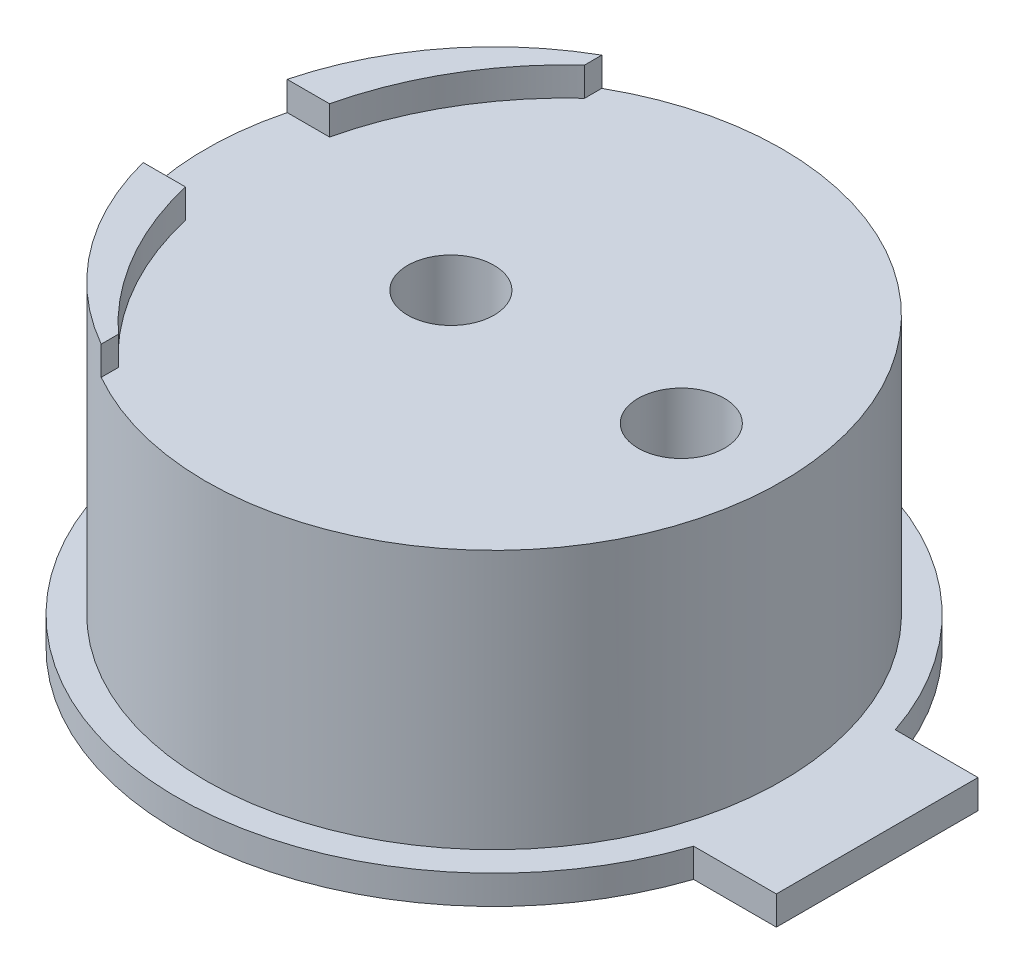
ISO-10303-21;
HEADER;
FILE_DESCRIPTION(('STEP AP214'),'2;1');
FILE_NAME('part.step','',(''),(''),'','','');
FILE_SCHEMA(('AUTOMOTIVE_DESIGN { 1 0 10303 214 1 1 1 1 }'));
ENDSEC;
DATA;
#1=APPLICATION_CONTEXT('core data for automotive mechanical design processes');
#2=APPLICATION_PROTOCOL_DEFINITION('international standard','automotive_design',2000,#1);
#3=PRODUCT_CONTEXT('',#1,'mechanical');
#4=PRODUCT('Part','Part','',(#3));
#5=PRODUCT_RELATED_PRODUCT_CATEGORY('part','',(#4));
#6=PRODUCT_DEFINITION_FORMATION('','',#4);
#7=PRODUCT_DEFINITION_CONTEXT('part definition',#1,'design');
#8=PRODUCT_DEFINITION('design','',#6,#7);
#9=PRODUCT_DEFINITION_SHAPE('','',#8);
#10=(LENGTH_UNIT() NAMED_UNIT(*) SI_UNIT(.MILLI.,.METRE.));
#11=(NAMED_UNIT(*) PLANE_ANGLE_UNIT() SI_UNIT($,.RADIAN.));
#12=(NAMED_UNIT(*) SI_UNIT($,.STERADIAN.) SOLID_ANGLE_UNIT());
#13=UNCERTAINTY_MEASURE_WITH_UNIT(LENGTH_MEASURE(1.E-05),#10,'distance_accuracy_value','');
#14=(GEOMETRIC_REPRESENTATION_CONTEXT(3) GLOBAL_UNCERTAINTY_ASSIGNED_CONTEXT((#13)) GLOBAL_UNIT_ASSIGNED_CONTEXT((#10,
#11,#12)) REPRESENTATION_CONTEXT('',''));
#15=CARTESIAN_POINT('',(0.,0.,0.));
#16=DIRECTION('',(0.,0.,1.));
#17=DIRECTION('',(1.,0.,0.));
#18=AXIS2_PLACEMENT_3D('',#15,#16,#17);
#19=CARTESIAN_POINT('',(-2.5,30.,0.));
#20=DIRECTION('',(0.,-1.,0.));
#21=DIRECTION('',(0.,0.,-1.));
#22=AXIS2_PLACEMENT_3D('',#19,#20,#21);
#23=CYLINDRICAL_SURFACE('',#22,10.);
#24=CARTESIAN_POINT('',(-2.5,21.,0.));
#25=DIRECTION('',(0.,1.,0.));
#26=DIRECTION('',(0.,0.,1.));
#27=AXIS2_PLACEMENT_3D('',#24,#25,#26);
#28=CIRCLE('',#27,10.);
#29=CARTESIAN_POINT('',(-2.5,21.,10.));
#30=VERTEX_POINT('',#29);
#31=EDGE_CURVE('E192',#30,#30,#28,.T.);
#32=ORIENTED_EDGE('',*,*,#31,.T.);
#33=EDGE_LOOP('',(#32));
#34=FACE_BOUND('',#33,.T.);
#35=CARTESIAN_POINT('',(-2.5,31.,0.));
#36=DIRECTION('',(0.,1.,0.));
#37=DIRECTION('',(0.,0.,1.));
#38=AXIS2_PLACEMENT_3D('',#35,#36,#37);
#39=CIRCLE('',#38,10.);
#40=CARTESIAN_POINT('',(-7.44999999999999,31.,-8.68892973846607));
#41=VERTEX_POINT('',#40);
#42=CARTESIAN_POINT('',(-12.1824583655185,31.,-2.5));
#43=VERTEX_POINT('',#42);
#44=EDGE_CURVE('E57',#41,#43,#39,.T.);
#45=ORIENTED_EDGE('',*,*,#44,.F.);
#46=DIRECTION('',(0.,1.,0.));
#47=VECTOR('',#46,1.);
#48=CARTESIAN_POINT('',(-7.44999999999999,30.,-8.68892973846607));
#49=LINE('',#48,#47);
#50=CARTESIAN_POINT('',(-7.44999999999999,30.,-8.68892973846607));
#51=VERTEX_POINT('',#50);
#52=EDGE_CURVE('E136',#51,#41,#49,.T.);
#53=ORIENTED_EDGE('',*,*,#52,.F.);
#54=CARTESIAN_POINT('',(-2.5,30.,0.));
#55=DIRECTION('',(0.,1.,0.));
#56=DIRECTION('',(0.,0.,1.));
#57=AXIS2_PLACEMENT_3D('',#54,#55,#56);
#58=CIRCLE('',#57,10.);
#59=CARTESIAN_POINT('',(-7.44999999999999,30.,8.68892973846607));
#60=VERTEX_POINT('',#59);
#61=EDGE_CURVE('E123',#60,#51,#58,.T.);
#62=ORIENTED_EDGE('',*,*,#61,.F.);
#63=DIRECTION('',(0.,1.,0.));
#64=VECTOR('',#63,1.);
#65=CARTESIAN_POINT('',(-7.44999999999999,30.,8.68892973846607));
#66=LINE('',#65,#64);
#67=CARTESIAN_POINT('',(-7.44999999999999,31.,8.68892973846607));
#68=VERTEX_POINT('',#67);
#69=EDGE_CURVE('E149',#60,#68,#66,.T.);
#70=ORIENTED_EDGE('',*,*,#69,.T.);
#71=CARTESIAN_POINT('',(-12.1824583655185,31.,2.5));
#72=VERTEX_POINT('',#71);
#73=EDGE_CURVE('E221',#72,#68,#39,.T.);
#74=ORIENTED_EDGE('',*,*,#73,.F.);
#75=DIRECTION('',(0.,-1.,0.));
#76=VECTOR('',#75,1.);
#77=CARTESIAN_POINT('',(-12.1824583655185,30.,2.5));
#78=LINE('',#77,#76);
#79=CARTESIAN_POINT('',(-12.1824583655185,30.,2.5));
#80=VERTEX_POINT('',#79);
#81=EDGE_CURVE('E11',#72,#80,#78,.T.);
#82=ORIENTED_EDGE('',*,*,#81,.T.);
#83=CARTESIAN_POINT('',(-2.5,30.,0.));
#84=DIRECTION('',(0.,1.,0.));
#85=DIRECTION('',(0.,0.,1.));
#86=AXIS2_PLACEMENT_3D('',#83,#84,#85);
#87=CIRCLE('',#86,10.);
#88=CARTESIAN_POINT('',(-12.1824583655185,30.,-2.5));
#89=VERTEX_POINT('',#88);
#90=EDGE_CURVE('E132',#89,#80,#87,.T.);
#91=ORIENTED_EDGE('',*,*,#90,.F.);
#92=DIRECTION('',(0.,-1.,0.));
#93=VECTOR('',#92,1.);
#94=CARTESIAN_POINT('',(-12.1824583655185,30.,-2.5));
#95=LINE('',#94,#93);
#96=EDGE_CURVE('E42',#43,#89,#95,.T.);
#97=ORIENTED_EDGE('',*,*,#96,.F.);
#98=EDGE_LOOP('',(#45,#53,#62,#70,#74,#82,#91,#97));
#99=FACE_BOUND('',#98,.T.);
#100=ADVANCED_FACE('F35',(#34,#99),#23,.T.);
#101=CARTESIAN_POINT('',(0.,31.,0.));
#102=DIRECTION('',(0.,1.,0.));
#103=DIRECTION('',(0.,0.,1.));
#104=AXIS2_PLACEMENT_3D('',#101,#102,#103);
#105=PLANE('',#104);
#106=ORIENTED_EDGE('',*,*,#73,.T.);
#107=DIRECTION('',(0.,0.,-1.));
#108=VECTOR('',#107,1.);
#109=CARTESIAN_POINT('',(-7.44999999999999,31.,0.));
#110=LINE('',#109,#108);
#111=CARTESIAN_POINT('',(-7.44999999999999,31.,8.09305257612973));
#112=VERTEX_POINT('',#111);
#113=EDGE_CURVE('E150',#68,#112,#110,.T.);
#114=ORIENTED_EDGE('',*,*,#113,.T.);
#115=CARTESIAN_POINT('',(0.,31.,0.));
#116=DIRECTION('',(0.,1.,0.));
#117=DIRECTION('',(0.,0.,1.));
#118=AXIS2_PLACEMENT_3D('',#115,#116,#117);
#119=CIRCLE('',#118,11.);
#120=CARTESIAN_POINT('',(-10.7121426428143,31.,2.5));
#121=VERTEX_POINT('',#120);
#122=EDGE_CURVE('E197',#121,#112,#119,.T.);
#123=ORIENTED_EDGE('',*,*,#122,.F.);
#124=DIRECTION('',(1.,0.,0.));
#125=VECTOR('',#124,1.);
#126=CARTESIAN_POINT('',(0.,31.,2.5));
#127=LINE('',#126,#125);
#128=EDGE_CURVE('E205',#72,#121,#127,.T.);
#129=ORIENTED_EDGE('',*,*,#128,.F.);
#130=EDGE_LOOP('',(#106,#114,#123,#129));
#131=FACE_BOUND('',#130,.T.);
#132=ADVANCED_FACE('F239',(#131),#105,.T.);
#133=CARTESIAN_POINT('',(0.,30.,0.));
#134=DIRECTION('',(0.,1.,0.));
#135=DIRECTION('',(0.,0.,1.));
#136=AXIS2_PLACEMENT_3D('',#133,#134,#135);
#137=CYLINDRICAL_SURFACE('',#136,11.);
#138=DIRECTION('',(0.,1.,0.));
#139=VECTOR('',#138,1.);
#140=CARTESIAN_POINT('',(-7.44999999999999,30.,8.09305257612973));
#141=LINE('',#140,#139);
#142=CARTESIAN_POINT('',(-7.44999999999999,30.,8.09305257612973));
#143=VERTEX_POINT('',#142);
#144=EDGE_CURVE('E153',#143,#112,#141,.T.);
#145=ORIENTED_EDGE('',*,*,#144,.F.);
#146=CARTESIAN_POINT('',(0.,30.,0.));
#147=DIRECTION('',(0.,1.,0.));
#148=DIRECTION('',(0.,0.,1.));
#149=AXIS2_PLACEMENT_3D('',#146,#147,#148);
#150=CIRCLE('',#149,11.);
#151=CARTESIAN_POINT('',(-10.7121426428143,30.,2.5));
#152=VERTEX_POINT('',#151);
#153=EDGE_CURVE('E200',#152,#143,#150,.T.);
#154=ORIENTED_EDGE('',*,*,#153,.F.);
#155=DIRECTION('',(0.,1.,0.));
#156=VECTOR('',#155,1.);
#157=CARTESIAN_POINT('',(-10.7121426428143,30.,2.5));
#158=LINE('',#157,#156);
#159=EDGE_CURVE('E202',#152,#121,#158,.T.);
#160=ORIENTED_EDGE('',*,*,#159,.T.);
#161=ORIENTED_EDGE('',*,*,#122,.T.);
#162=EDGE_LOOP('',(#145,#154,#160,#161));
#163=FACE_BOUND('',#162,.T.);
#164=ADVANCED_FACE('F242',(#163),#137,.F.);
#165=CARTESIAN_POINT('',(4.,3.,0.));
#166=DIRECTION('',(0.,1.,0.));
#167=DIRECTION('',(0.,0.,1.));
#168=AXIS2_PLACEMENT_3D('',#165,#166,#167);
#169=CYLINDRICAL_SURFACE('',#168,1.5);
#170=CARTESIAN_POINT('',(4.,30.,0.));
#171=DIRECTION('',(0.,1.,0.));
#172=DIRECTION('',(0.,0.,1.));
#173=AXIS2_PLACEMENT_3D('',#170,#171,#172);
#174=CIRCLE('',#173,1.5);
#175=CARTESIAN_POINT('',(4.,30.,1.5));
#176=VERTEX_POINT('',#175);
#177=EDGE_CURVE('E213',#176,#176,#174,.F.);
#178=ORIENTED_EDGE('',*,*,#177,.F.);
#179=EDGE_LOOP('',(#178));
#180=FACE_BOUND('',#179,.T.);
#181=CARTESIAN_POINT('',(4.,20.,0.));
#182=DIRECTION('',(0.,-1.,0.));
#183=DIRECTION('',(0.,0.,-1.));
#184=AXIS2_PLACEMENT_3D('',#181,#182,#183);
#185=CIRCLE('',#184,1.5);
#186=CARTESIAN_POINT('',(4.,20.,-1.5));
#187=VERTEX_POINT('',#186);
#188=EDGE_CURVE('E167',#187,#187,#185,.F.);
#189=ORIENTED_EDGE('',*,*,#188,.F.);
#190=EDGE_LOOP('',(#189));
#191=FACE_BOUND('',#190,.T.);
#192=ADVANCED_FACE('F292',(#180,#191),#169,.F.);
#193=CARTESIAN_POINT('',(-4.,3.,0.));
#194=DIRECTION('',(0.,1.,0.));
#195=DIRECTION('',(0.,0.,1.));
#196=AXIS2_PLACEMENT_3D('',#193,#194,#195);
#197=CYLINDRICAL_SURFACE('',#196,1.5);
#198=CARTESIAN_POINT('',(-4.,30.,0.));
#199=DIRECTION('',(0.,1.,0.));
#200=DIRECTION('',(0.,0.,1.));
#201=AXIS2_PLACEMENT_3D('',#198,#199,#200);
#202=CIRCLE('',#201,1.5);
#203=CARTESIAN_POINT('',(-4.,30.,1.5));
#204=VERTEX_POINT('',#203);
#205=EDGE_CURVE('E218',#204,#204,#202,.F.);
#206=ORIENTED_EDGE('',*,*,#205,.F.);
#207=EDGE_LOOP('',(#206));
#208=FACE_BOUND('',#207,.T.);
#209=CARTESIAN_POINT('',(-4.,20.,0.));
#210=DIRECTION('',(0.,-1.,0.));
#211=DIRECTION('',(0.,0.,-1.));
#212=AXIS2_PLACEMENT_3D('',#209,#210,#211);
#213=CIRCLE('',#212,1.5);
#214=CARTESIAN_POINT('',(-4.,20.,-1.5));
#215=VERTEX_POINT('',#214);
#216=EDGE_CURVE('E170',#215,#215,#213,.F.);
#217=ORIENTED_EDGE('',*,*,#216,.F.);
#218=EDGE_LOOP('',(#217));
#219=FACE_BOUND('',#218,.T.);
#220=ADVANCED_FACE('F290',(#208,#219),#197,.F.);
#221=DIRECTION('',(0.,0.,1.));
#222=VECTOR('',#221,1.);
#223=CARTESIAN_POINT('',(-7.44999999999999,31.,0.));
#224=LINE('',#223,#222);
#225=CARTESIAN_POINT('',(-7.44999999999999,31.,-8.09305257612973));
#226=VERTEX_POINT('',#225);
#227=EDGE_CURVE('E140',#41,#226,#224,.T.);
#228=ORIENTED_EDGE('',*,*,#227,.F.);
#229=ORIENTED_EDGE('',*,*,#44,.T.);
#230=DIRECTION('',(1.,0.,0.));
#231=VECTOR('',#230,1.);
#232=CARTESIAN_POINT('',(0.,31.,-2.5));
#233=LINE('',#232,#231);
#234=CARTESIAN_POINT('',(-10.7121426428143,31.,-2.5));
#235=VERTEX_POINT('',#234);
#236=EDGE_CURVE('E203',#43,#235,#233,.T.);
#237=ORIENTED_EDGE('',*,*,#236,.T.);
#238=EDGE_CURVE('E207',#226,#235,#119,.T.);
#239=ORIENTED_EDGE('',*,*,#238,.F.);
#240=EDGE_LOOP('',(#228,#229,#237,#239));
#241=FACE_BOUND('',#240,.T.);
#242=ADVANCED_FACE('F263',(#241),#105,.T.);
#243=CARTESIAN_POINT('',(0.,30.,0.));
#244=DIRECTION('',(0.,1.,0.));
#245=DIRECTION('',(0.,0.,1.));
#246=AXIS2_PLACEMENT_3D('',#243,#244,#245);
#247=PLANE('',#246);
#248=ORIENTED_EDGE('',*,*,#90,.T.);
#249=DIRECTION('',(1.,0.,0.));
#250=VECTOR('',#249,1.);
#251=CARTESIAN_POINT('',(0.,30.,2.5));
#252=LINE('',#251,#250);
#253=EDGE_CURVE('E196',#80,#152,#252,.T.);
#254=ORIENTED_EDGE('',*,*,#253,.T.);
#255=ORIENTED_EDGE('',*,*,#153,.T.);
#256=DIRECTION('',(0.,0.,-1.));
#257=VECTOR('',#256,1.);
#258=CARTESIAN_POINT('',(-7.44999999999999,30.,0.));
#259=LINE('',#258,#257);
#260=EDGE_CURVE('E127',#60,#143,#259,.T.);
#261=ORIENTED_EDGE('',*,*,#260,.F.);
#262=ORIENTED_EDGE('',*,*,#61,.T.);
#263=DIRECTION('',(0.,0.,1.));
#264=VECTOR('',#263,1.);
#265=CARTESIAN_POINT('',(-7.44999999999999,30.,0.));
#266=LINE('',#265,#264);
#267=CARTESIAN_POINT('',(-7.44999999999999,30.,-8.09305257612973));
#268=VERTEX_POINT('',#267);
#269=EDGE_CURVE('E49',#51,#268,#266,.T.);
#270=ORIENTED_EDGE('',*,*,#269,.T.);
#271=CARTESIAN_POINT('',(-10.7121426428143,30.,-2.5));
#272=VERTEX_POINT('',#271);
#273=EDGE_CURVE('E199',#268,#272,#150,.T.);
#274=ORIENTED_EDGE('',*,*,#273,.T.);
#275=DIRECTION('',(1.,0.,0.));
#276=VECTOR('',#275,1.);
#277=CARTESIAN_POINT('',(0.,30.,-2.5));
#278=LINE('',#277,#276);
#279=EDGE_CURVE('E193',#89,#272,#278,.T.);
#280=ORIENTED_EDGE('',*,*,#279,.F.);
#281=EDGE_LOOP('',(#248,#254,#255,#261,#262,#270,#274,#280));
#282=FACE_BOUND('',#281,.T.);
#283=ORIENTED_EDGE('',*,*,#177,.T.);
#284=EDGE_LOOP('',(#283));
#285=FACE_BOUND('',#284,.T.);
#286=ORIENTED_EDGE('',*,*,#205,.T.);
#287=EDGE_LOOP('',(#286));
#288=FACE_BOUND('',#287,.T.);
#289=ADVANCED_FACE('F124',(#282,#285,#288),#247,.T.);
#290=CARTESIAN_POINT('',(0.,30.,-2.5));
#291=DIRECTION('',(0.,0.,1.));
#292=DIRECTION('',(0.,-1.,0.));
#293=AXIS2_PLACEMENT_3D('',#290,#291,#292);
#294=PLANE('',#293);
#295=ORIENTED_EDGE('',*,*,#96,.T.);
#296=ORIENTED_EDGE('',*,*,#279,.T.);
#297=DIRECTION('',(0.,1.,0.));
#298=VECTOR('',#297,1.);
#299=CARTESIAN_POINT('',(-10.7121426428143,30.,-2.5));
#300=LINE('',#299,#298);
#301=EDGE_CURVE('E210',#272,#235,#300,.T.);
#302=ORIENTED_EDGE('',*,*,#301,.T.);
#303=ORIENTED_EDGE('',*,*,#236,.F.);
#304=EDGE_LOOP('',(#295,#296,#302,#303));
#305=FACE_BOUND('',#304,.T.);
#306=ADVANCED_FACE('F227',(#305),#294,.T.);
#307=CARTESIAN_POINT('',(0.,30.,2.5));
#308=DIRECTION('',(0.,0.,1.));
#309=DIRECTION('',(0.,-1.,0.));
#310=AXIS2_PLACEMENT_3D('',#307,#308,#309);
#311=PLANE('',#310);
#312=ORIENTED_EDGE('',*,*,#128,.T.);
#313=ORIENTED_EDGE('',*,*,#159,.F.);
#314=ORIENTED_EDGE('',*,*,#253,.F.);
#315=ORIENTED_EDGE('',*,*,#81,.F.);
#316=EDGE_LOOP('',(#312,#313,#314,#315));
#317=FACE_BOUND('',#316,.T.);
#318=ADVANCED_FACE('F235',(#317),#311,.F.);
#319=ORIENTED_EDGE('',*,*,#273,.F.);
#320=DIRECTION('',(0.,1.,0.));
#321=VECTOR('',#320,1.);
#322=CARTESIAN_POINT('',(-7.44999999999999,30.,-8.09305257612973));
#323=LINE('',#322,#321);
#324=EDGE_CURVE('E138',#268,#226,#323,.T.);
#325=ORIENTED_EDGE('',*,*,#324,.T.);
#326=ORIENTED_EDGE('',*,*,#238,.T.);
#327=ORIENTED_EDGE('',*,*,#301,.F.);
#328=EDGE_LOOP('',(#319,#325,#326,#327));
#329=FACE_BOUND('',#328,.T.);
#330=ADVANCED_FACE('F307',(#329),#137,.F.);
#331=CARTESIAN_POINT('',(-2.5,20.,0.));
#332=DIRECTION('',(0.,1.,0.));
#333=DIRECTION('',(0.,0.,1.));
#334=AXIS2_PLACEMENT_3D('',#331,#332,#333);
#335=CYLINDRICAL_SURFACE('',#334,11.);
#336=CARTESIAN_POINT('',(-2.5,21.,0.));
#337=DIRECTION('',(0.,-1.,0.));
#338=DIRECTION('',(0.,0.,-1.));
#339=AXIS2_PLACEMENT_3D('',#336,#337,#338);
#340=CIRCLE('',#339,11.);
#341=CARTESIAN_POINT('',(7.9283268073071,21.,3.5));
#342=VERTEX_POINT('',#341);
#343=CARTESIAN_POINT('',(7.9283268073071,21.,-3.5));
#344=VERTEX_POINT('',#343);
#345=EDGE_CURVE('E144',#342,#344,#340,.T.);
#346=ORIENTED_EDGE('',*,*,#345,.T.);
#347=DIRECTION('',(0.,1.,0.));
#348=VECTOR('',#347,1.);
#349=CARTESIAN_POINT('',(7.9283268073071,20.,-3.5));
#350=LINE('',#349,#348);
#351=CARTESIAN_POINT('',(7.9283268073071,20.,-3.5));
#352=VERTEX_POINT('',#351);
#353=EDGE_CURVE('E189',#352,#344,#350,.T.);
#354=ORIENTED_EDGE('',*,*,#353,.F.);
#355=CARTESIAN_POINT('',(-2.5,20.,0.));
#356=DIRECTION('',(0.,-1.,0.));
#357=DIRECTION('',(0.,0.,-1.));
#358=AXIS2_PLACEMENT_3D('',#355,#356,#357);
#359=CIRCLE('',#358,11.);
#360=CARTESIAN_POINT('',(7.9283268073071,20.,3.5));
#361=VERTEX_POINT('',#360);
#362=EDGE_CURVE('E156',#361,#352,#359,.T.);
#363=ORIENTED_EDGE('',*,*,#362,.F.);
#364=DIRECTION('',(0.,1.,0.));
#365=VECTOR('',#364,1.);
#366=CARTESIAN_POINT('',(7.9283268073071,20.,3.5));
#367=LINE('',#366,#365);
#368=EDGE_CURVE('E173',#361,#342,#367,.T.);
#369=ORIENTED_EDGE('',*,*,#368,.T.);
#370=EDGE_LOOP('',(#346,#354,#363,#369));
#371=FACE_BOUND('',#370,.T.);
#372=ADVANCED_FACE('F282',(#371),#335,.T.);
#373=CARTESIAN_POINT('',(0.,20.,-3.5));
#374=DIRECTION('',(0.,0.,1.));
#375=DIRECTION('',(1.,0.,0.));
#376=AXIS2_PLACEMENT_3D('',#373,#374,#375);
#377=PLANE('',#376);
#378=DIRECTION('',(1.,0.,0.));
#379=VECTOR('',#378,1.);
#380=CARTESIAN_POINT('',(0.,21.,-3.5));
#381=LINE('',#380,#379);
#382=CARTESIAN_POINT('',(10.8,21.,-3.5));
#383=VERTEX_POINT('',#382);
#384=EDGE_CURVE('E176',#344,#383,#381,.T.);
#385=ORIENTED_EDGE('',*,*,#384,.T.);
#386=DIRECTION('',(0.,1.,0.));
#387=VECTOR('',#386,1.);
#388=CARTESIAN_POINT('',(10.8,20.,-3.5));
#389=LINE('',#388,#387);
#390=CARTESIAN_POINT('',(10.8,20.,-3.5));
#391=VERTEX_POINT('',#390);
#392=EDGE_CURVE('E186',#391,#383,#389,.T.);
#393=ORIENTED_EDGE('',*,*,#392,.F.);
#394=DIRECTION('',(1.,0.,0.));
#395=VECTOR('',#394,1.);
#396=CARTESIAN_POINT('',(0.,20.,-3.5));
#397=LINE('',#396,#395);
#398=EDGE_CURVE('E159',#352,#391,#397,.T.);
#399=ORIENTED_EDGE('',*,*,#398,.F.);
#400=ORIENTED_EDGE('',*,*,#353,.T.);
#401=EDGE_LOOP('',(#385,#393,#399,#400));
#402=FACE_BOUND('',#401,.T.);
#403=ADVANCED_FACE('F281',(#402),#377,.F.);
#404=CARTESIAN_POINT('',(10.8,20.,0.));
#405=DIRECTION('',(-1.,0.,0.));
#406=DIRECTION('',(0.,0.,1.));
#407=AXIS2_PLACEMENT_3D('',#404,#405,#406);
#408=PLANE('',#407);
#409=DIRECTION('',(0.,0.,1.));
#410=VECTOR('',#409,1.);
#411=CARTESIAN_POINT('',(10.8,21.,0.));
#412=LINE('',#411,#410);
#413=CARTESIAN_POINT('',(10.8,21.,3.5));
#414=VERTEX_POINT('',#413);
#415=EDGE_CURVE('E178',#383,#414,#412,.T.);
#416=ORIENTED_EDGE('',*,*,#415,.T.);
#417=DIRECTION('',(0.,1.,0.));
#418=VECTOR('',#417,1.);
#419=CARTESIAN_POINT('',(10.8,20.,3.5));
#420=LINE('',#419,#418);
#421=CARTESIAN_POINT('',(10.8,20.,3.5));
#422=VERTEX_POINT('',#421);
#423=EDGE_CURVE('E184',#422,#414,#420,.T.);
#424=ORIENTED_EDGE('',*,*,#423,.F.);
#425=DIRECTION('',(0.,0.,1.));
#426=VECTOR('',#425,1.);
#427=CARTESIAN_POINT('',(10.8,20.,0.));
#428=LINE('',#427,#426);
#429=EDGE_CURVE('E162',#391,#422,#428,.T.);
#430=ORIENTED_EDGE('',*,*,#429,.F.);
#431=ORIENTED_EDGE('',*,*,#392,.T.);
#432=EDGE_LOOP('',(#416,#424,#430,#431));
#433=FACE_BOUND('',#432,.T.);
#434=ADVANCED_FACE('F278',(#433),#408,.F.);
#435=CARTESIAN_POINT('',(0.,20.,3.5));
#436=DIRECTION('',(0.,0.,1.));
#437=DIRECTION('',(1.,0.,0.));
#438=AXIS2_PLACEMENT_3D('',#435,#436,#437);
#439=PLANE('',#438);
#440=DIRECTION('',(1.,0.,0.));
#441=VECTOR('',#440,1.);
#442=CARTESIAN_POINT('',(0.,21.,3.5));
#443=LINE('',#442,#441);
#444=EDGE_CURVE('E160',#342,#414,#443,.T.);
#445=ORIENTED_EDGE('',*,*,#444,.F.);
#446=ORIENTED_EDGE('',*,*,#368,.F.);
#447=DIRECTION('',(1.,0.,0.));
#448=VECTOR('',#447,1.);
#449=CARTESIAN_POINT('',(0.,20.,3.5));
#450=LINE('',#449,#448);
#451=EDGE_CURVE('E164',#361,#422,#450,.T.);
#452=ORIENTED_EDGE('',*,*,#451,.T.);
#453=ORIENTED_EDGE('',*,*,#423,.T.);
#454=EDGE_LOOP('',(#445,#446,#452,#453));
#455=FACE_BOUND('',#454,.T.);
#456=ADVANCED_FACE('F272',(#455),#439,.T.);
#457=CARTESIAN_POINT('',(0.,20.,0.));
#458=DIRECTION('',(0.,-1.,0.));
#459=DIRECTION('',(0.,0.,-1.));
#460=AXIS2_PLACEMENT_3D('',#457,#458,#459);
#461=PLANE('',#460);
#462=ORIENTED_EDGE('',*,*,#362,.T.);
#463=ORIENTED_EDGE('',*,*,#398,.T.);
#464=ORIENTED_EDGE('',*,*,#429,.T.);
#465=ORIENTED_EDGE('',*,*,#451,.F.);
#466=EDGE_LOOP('',(#462,#463,#464,#465));
#467=FACE_BOUND('',#466,.T.);
#468=ORIENTED_EDGE('',*,*,#188,.T.);
#469=EDGE_LOOP('',(#468));
#470=FACE_BOUND('',#469,.T.);
#471=ORIENTED_EDGE('',*,*,#216,.T.);
#472=EDGE_LOOP('',(#471));
#473=FACE_BOUND('',#472,.T.);
#474=ADVANCED_FACE('F254',(#467,#470,#473),#461,.T.);
#475=CARTESIAN_POINT('',(0.,21.,0.));
#476=DIRECTION('',(0.,-1.,0.));
#477=DIRECTION('',(0.,0.,-1.));
#478=AXIS2_PLACEMENT_3D('',#475,#476,#477);
#479=PLANE('',#478);
#480=ORIENTED_EDGE('',*,*,#31,.F.);
#481=EDGE_LOOP('',(#480));
#482=FACE_BOUND('',#481,.T.);
#483=ORIENTED_EDGE('',*,*,#345,.F.);
#484=ORIENTED_EDGE('',*,*,#444,.T.);
#485=ORIENTED_EDGE('',*,*,#415,.F.);
#486=ORIENTED_EDGE('',*,*,#384,.F.);
#487=EDGE_LOOP('',(#483,#484,#485,#486));
#488=FACE_BOUND('',#487,.T.);
#489=ADVANCED_FACE('F247',(#482,#488),#479,.F.);
#490=CARTESIAN_POINT('',(-7.44999999999999,30.,0.));
#491=DIRECTION('',(1.,0.,0.));
#492=DIRECTION('',(0.,1.,0.));
#493=AXIS2_PLACEMENT_3D('',#490,#491,#492);
#494=PLANE('',#493);
#495=ORIENTED_EDGE('',*,*,#113,.F.);
#496=ORIENTED_EDGE('',*,*,#69,.F.);
#497=ORIENTED_EDGE('',*,*,#260,.T.);
#498=ORIENTED_EDGE('',*,*,#144,.T.);
#499=EDGE_LOOP('',(#495,#496,#497,#498));
#500=FACE_BOUND('',#499,.T.);
#501=ADVANCED_FACE('F245',(#500),#494,.T.);
#502=CARTESIAN_POINT('',(-7.44999999999999,30.,0.));
#503=DIRECTION('',(-1.,0.,0.));
#504=DIRECTION('',(0.,-1.,0.));
#505=AXIS2_PLACEMENT_3D('',#502,#503,#504);
#506=PLANE('',#505);
#507=ORIENTED_EDGE('',*,*,#227,.T.);
#508=ORIENTED_EDGE('',*,*,#324,.F.);
#509=ORIENTED_EDGE('',*,*,#269,.F.);
#510=ORIENTED_EDGE('',*,*,#52,.T.);
#511=EDGE_LOOP('',(#507,#508,#509,#510));
#512=FACE_BOUND('',#511,.T.);
#513=ADVANCED_FACE('F135',(#512),#506,.F.);
#514=CLOSED_SHELL('',(#100,#132,#164,#192,#220,#242,#289,#306,#318,#330,#372,#403,#434,#456,
#474,#489,#501,#513));
#515=MANIFOLD_SOLID_BREP('B2',#514);
#516=ADVANCED_BREP_SHAPE_REPRESENTATION('',(#18,#515),#14);
#517=SHAPE_DEFINITION_REPRESENTATION(#9,#516);
ENDSEC;
END-ISO-10303-21;
